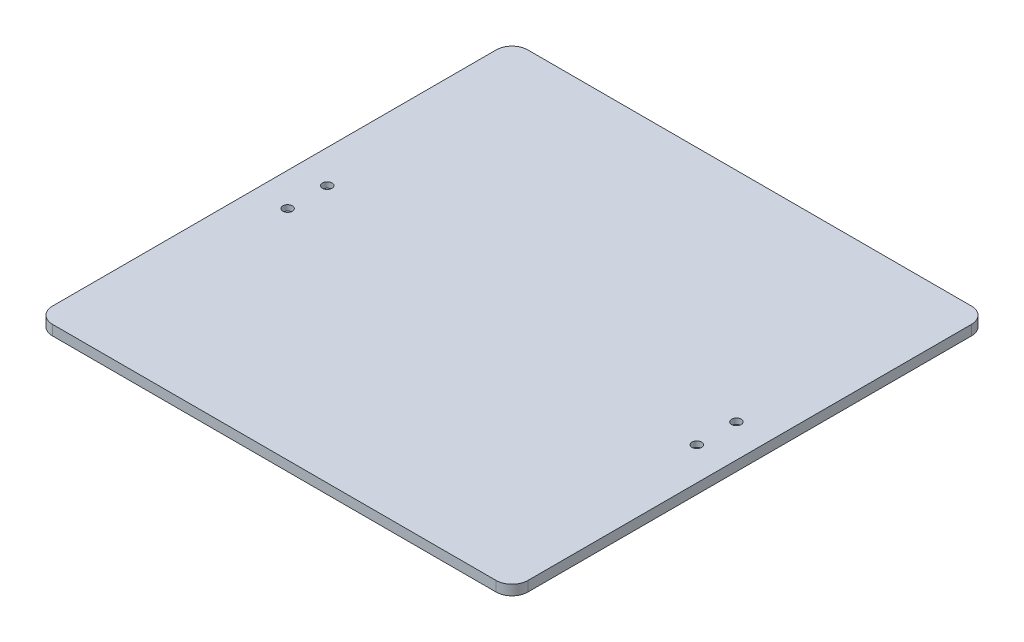
ISO-10303-21;
HEADER;
FILE_DESCRIPTION(('STEP AP214'),'2;1');
FILE_NAME('part.step','',(''),(''),'','','');
FILE_SCHEMA(('AUTOMOTIVE_DESIGN { 1 0 10303 214 1 1 1 1 }'));
ENDSEC;
DATA;
#1=APPLICATION_CONTEXT('core data for automotive mechanical design processes');
#2=APPLICATION_PROTOCOL_DEFINITION('international standard','automotive_design',2000,#1);
#3=PRODUCT_CONTEXT('',#1,'mechanical');
#4=PRODUCT('Part','Part','',(#3));
#5=PRODUCT_RELATED_PRODUCT_CATEGORY('part','',(#4));
#6=PRODUCT_DEFINITION_FORMATION('','',#4);
#7=PRODUCT_DEFINITION_CONTEXT('part definition',#1,'design');
#8=PRODUCT_DEFINITION('design','',#6,#7);
#9=PRODUCT_DEFINITION_SHAPE('','',#8);
#10=(LENGTH_UNIT() NAMED_UNIT(*) SI_UNIT(.MILLI.,.METRE.));
#11=(NAMED_UNIT(*) PLANE_ANGLE_UNIT() SI_UNIT($,.RADIAN.));
#12=(NAMED_UNIT(*) SI_UNIT($,.STERADIAN.) SOLID_ANGLE_UNIT());
#13=UNCERTAINTY_MEASURE_WITH_UNIT(LENGTH_MEASURE(1.E-05),#10,'distance_accuracy_value','');
#14=(GEOMETRIC_REPRESENTATION_CONTEXT(3) GLOBAL_UNCERTAINTY_ASSIGNED_CONTEXT((#13)) GLOBAL_UNIT_ASSIGNED_CONTEXT((#10,
#11,#12)) REPRESENTATION_CONTEXT('',''));
#15=CARTESIAN_POINT('',(0.,0.,0.));
#16=DIRECTION('',(0.,0.,1.));
#17=DIRECTION('',(1.,0.,0.));
#18=AXIS2_PLACEMENT_3D('',#15,#16,#17);
#19=CARTESIAN_POINT('',(129.12,0.,12.5));
#20=DIRECTION('',(0.,1.,0.));
#21=DIRECTION('',(0.,0.,1.));
#22=AXIS2_PLACEMENT_3D('',#19,#20,#21);
#23=CYLINDRICAL_SURFACE('',#22,1.75000000000001);
#24=CARTESIAN_POINT('',(129.12,0.,12.5));
#25=DIRECTION('',(0.,1.,0.));
#26=DIRECTION('',(0.,0.,1.));
#27=AXIS2_PLACEMENT_3D('',#24,#25,#26);
#28=CIRCLE('',#27,1.75000000000001);
#29=CARTESIAN_POINT('',(129.12,0.,14.2500000000001));
#30=VERTEX_POINT('',#29);
#31=EDGE_CURVE('E166',#30,#30,#28,.T.);
#32=ORIENTED_EDGE('',*,*,#31,.F.);
#33=EDGE_LOOP('',(#32));
#34=FACE_BOUND('',#33,.T.);
#35=CARTESIAN_POINT('',(129.12,2.85,12.5));
#36=DIRECTION('',(0.,1.,0.));
#37=DIRECTION('',(0.,0.,1.));
#38=AXIS2_PLACEMENT_3D('',#35,#36,#37);
#39=CIRCLE('',#38,1.75000000000001);
#40=CARTESIAN_POINT('',(129.12,2.85,14.2500000000001));
#41=VERTEX_POINT('',#40);
#42=EDGE_CURVE('E39',#41,#41,#39,.F.);
#43=ORIENTED_EDGE('',*,*,#42,.F.);
#44=EDGE_LOOP('',(#43));
#45=FACE_BOUND('',#44,.T.);
#46=ADVANCED_FACE('F35',(#34,#45),#23,.F.);
#47=CARTESIAN_POINT('',(-129.12,0.,12.5));
#48=DIRECTION('',(0.,1.,0.));
#49=DIRECTION('',(0.,0.,1.));
#50=AXIS2_PLACEMENT_3D('',#47,#48,#49);
#51=CYLINDRICAL_SURFACE('',#50,1.75000000000001);
#52=CARTESIAN_POINT('',(-129.12,0.,12.5));
#53=DIRECTION('',(0.,1.,0.));
#54=DIRECTION('',(0.,0.,1.));
#55=AXIS2_PLACEMENT_3D('',#52,#53,#54);
#56=CIRCLE('',#55,1.75000000000001);
#57=CARTESIAN_POINT('',(-129.12,0.,14.2500000000001));
#58=VERTEX_POINT('',#57);
#59=EDGE_CURVE('E202',#58,#58,#56,.T.);
#60=ORIENTED_EDGE('',*,*,#59,.F.);
#61=EDGE_LOOP('',(#60));
#62=FACE_BOUND('',#61,.T.);
#63=CARTESIAN_POINT('',(-129.12,2.85,12.5));
#64=DIRECTION('',(0.,1.,0.));
#65=DIRECTION('',(0.,0.,1.));
#66=AXIS2_PLACEMENT_3D('',#63,#64,#65);
#67=CIRCLE('',#66,1.75000000000001);
#68=CARTESIAN_POINT('',(-129.12,2.85,14.2500000000001));
#69=VERTEX_POINT('',#68);
#70=EDGE_CURVE('E172',#69,#69,#67,.F.);
#71=ORIENTED_EDGE('',*,*,#70,.F.);
#72=EDGE_LOOP('',(#71));
#73=FACE_BOUND('',#72,.T.);
#74=ADVANCED_FACE('F242',(#62,#73),#51,.F.);
#75=CARTESIAN_POINT('',(129.12,0.,-12.5));
#76=DIRECTION('',(0.,1.,0.));
#77=DIRECTION('',(0.,0.,1.));
#78=AXIS2_PLACEMENT_3D('',#75,#76,#77);
#79=CYLINDRICAL_SURFACE('',#78,1.75000000000001);
#80=CARTESIAN_POINT('',(129.12,0.,-12.5));
#81=DIRECTION('',(0.,1.,0.));
#82=DIRECTION('',(0.,0.,1.));
#83=AXIS2_PLACEMENT_3D('',#80,#81,#82);
#84=CIRCLE('',#83,1.75000000000001);
#85=CARTESIAN_POINT('',(129.12,0.,-10.7499999999999));
#86=VERTEX_POINT('',#85);
#87=EDGE_CURVE('E199',#86,#86,#84,.T.);
#88=ORIENTED_EDGE('',*,*,#87,.F.);
#89=EDGE_LOOP('',(#88));
#90=FACE_BOUND('',#89,.T.);
#91=CARTESIAN_POINT('',(129.12,2.85,-12.5));
#92=DIRECTION('',(0.,1.,0.));
#93=DIRECTION('',(0.,0.,1.));
#94=AXIS2_PLACEMENT_3D('',#91,#92,#93);
#95=CIRCLE('',#94,1.75000000000001);
#96=CARTESIAN_POINT('',(129.12,2.85,-10.7499999999999));
#97=VERTEX_POINT('',#96);
#98=EDGE_CURVE('E168',#97,#97,#95,.F.);
#99=ORIENTED_EDGE('',*,*,#98,.F.);
#100=EDGE_LOOP('',(#99));
#101=FACE_BOUND('',#100,.T.);
#102=ADVANCED_FACE('F249',(#90,#101),#79,.F.);
#103=CARTESIAN_POINT('',(-129.12,0.,-12.5));
#104=DIRECTION('',(0.,1.,0.));
#105=DIRECTION('',(0.,0.,1.));
#106=AXIS2_PLACEMENT_3D('',#103,#104,#105);
#107=CYLINDRICAL_SURFACE('',#106,1.75000000000001);
#108=CARTESIAN_POINT('',(-129.12,0.,-12.5));
#109=DIRECTION('',(0.,1.,0.));
#110=DIRECTION('',(0.,0.,1.));
#111=AXIS2_PLACEMENT_3D('',#108,#109,#110);
#112=CIRCLE('',#111,1.75000000000001);
#113=CARTESIAN_POINT('',(-129.12,0.,-10.7499999999999));
#114=VERTEX_POINT('',#113);
#115=EDGE_CURVE('E135',#114,#114,#112,.T.);
#116=ORIENTED_EDGE('',*,*,#115,.F.);
#117=EDGE_LOOP('',(#116));
#118=FACE_BOUND('',#117,.T.);
#119=CARTESIAN_POINT('',(-129.12,2.85,-12.5));
#120=DIRECTION('',(0.,1.,0.));
#121=DIRECTION('',(0.,0.,1.));
#122=AXIS2_PLACEMENT_3D('',#119,#120,#121);
#123=CIRCLE('',#122,1.75000000000001);
#124=CARTESIAN_POINT('',(-129.12,2.85,-10.7499999999999));
#125=VERTEX_POINT('',#124);
#126=EDGE_CURVE('E163',#125,#125,#123,.F.);
#127=ORIENTED_EDGE('',*,*,#126,.F.);
#128=EDGE_LOOP('',(#127));
#129=FACE_BOUND('',#128,.T.);
#130=ADVANCED_FACE('F257',(#118,#129),#107,.F.);
#131=CARTESIAN_POINT('',(150.,6.35,-150.));
#132=DIRECTION('',(-1.,0.,0.));
#133=DIRECTION('',(0.,0.,1.));
#134=AXIS2_PLACEMENT_3D('',#131,#132,#133);
#135=PLANE('',#134);
#136=DIRECTION('',(0.,0.,-1.));
#137=VECTOR('',#136,1.);
#138=CARTESIAN_POINT('',(150.,0.,-150.));
#139=LINE('',#138,#137);
#140=CARTESIAN_POINT('',(150.,0.,140.));
#141=VERTEX_POINT('',#140);
#142=CARTESIAN_POINT('',(150.,0.,-140.));
#143=VERTEX_POINT('',#142);
#144=EDGE_CURVE('E130',#141,#143,#139,.T.);
#145=ORIENTED_EDGE('',*,*,#144,.T.);
#146=DIRECTION('',(0.,-1.,0.));
#147=VECTOR('',#146,1.);
#148=CARTESIAN_POINT('',(150.,6.35,-140.));
#149=LINE('',#148,#147);
#150=CARTESIAN_POINT('',(150.,6.35,-140.));
#151=VERTEX_POINT('',#150);
#152=EDGE_CURVE('E108',#143,#151,#149,.F.);
#153=ORIENTED_EDGE('',*,*,#152,.T.);
#154=DIRECTION('',(0.,0.,-1.));
#155=VECTOR('',#154,1.);
#156=CARTESIAN_POINT('',(150.,6.35,-150.));
#157=LINE('',#156,#155);
#158=CARTESIAN_POINT('',(150.,6.35,140.));
#159=VERTEX_POINT('',#158);
#160=EDGE_CURVE('E140',#159,#151,#157,.T.);
#161=ORIENTED_EDGE('',*,*,#160,.F.);
#162=DIRECTION('',(0.,-1.,0.));
#163=VECTOR('',#162,1.);
#164=CARTESIAN_POINT('',(150.,6.35,140.));
#165=LINE('',#164,#163);
#166=EDGE_CURVE('E113',#159,#141,#165,.T.);
#167=ORIENTED_EDGE('',*,*,#166,.T.);
#168=EDGE_LOOP('',(#145,#153,#161,#167));
#169=FACE_BOUND('',#168,.T.);
#170=ADVANCED_FACE('F219',(#169),#135,.F.);
#171=CARTESIAN_POINT('',(-150.,6.35,-150.));
#172=DIRECTION('',(0.,0.,1.));
#173=DIRECTION('',(1.,0.,0.));
#174=AXIS2_PLACEMENT_3D('',#171,#172,#173);
#175=PLANE('',#174);
#176=DIRECTION('',(-1.,0.,0.));
#177=VECTOR('',#176,1.);
#178=CARTESIAN_POINT('',(-150.,6.35,-150.));
#179=LINE('',#178,#177);
#180=CARTESIAN_POINT('',(140.,6.35,-150.));
#181=VERTEX_POINT('',#180);
#182=CARTESIAN_POINT('',(-140.,6.35,-150.));
#183=VERTEX_POINT('',#182);
#184=EDGE_CURVE('E123',#181,#183,#179,.T.);
#185=ORIENTED_EDGE('',*,*,#184,.F.);
#186=DIRECTION('',(0.,-1.,0.));
#187=VECTOR('',#186,1.);
#188=CARTESIAN_POINT('',(140.,6.35,-150.));
#189=LINE('',#188,#187);
#190=CARTESIAN_POINT('',(140.,0.,-150.));
#191=VERTEX_POINT('',#190);
#192=EDGE_CURVE('E107',#181,#191,#189,.T.);
#193=ORIENTED_EDGE('',*,*,#192,.T.);
#194=DIRECTION('',(-1.,0.,0.));
#195=VECTOR('',#194,1.);
#196=CARTESIAN_POINT('',(-150.,0.,-150.));
#197=LINE('',#196,#195);
#198=CARTESIAN_POINT('',(-140.,0.,-150.));
#199=VERTEX_POINT('',#198);
#200=EDGE_CURVE('E120',#191,#199,#197,.T.);
#201=ORIENTED_EDGE('',*,*,#200,.T.);
#202=DIRECTION('',(0.,-1.,0.));
#203=VECTOR('',#202,1.);
#204=CARTESIAN_POINT('',(-140.,6.35,-150.));
#205=LINE('',#204,#203);
#206=EDGE_CURVE('E125',#199,#183,#205,.F.);
#207=ORIENTED_EDGE('',*,*,#206,.T.);
#208=EDGE_LOOP('',(#185,#193,#201,#207));
#209=FACE_BOUND('',#208,.T.);
#210=ADVANCED_FACE('F119',(#209),#175,.F.);
#211=CARTESIAN_POINT('',(-150.,6.35,-150.));
#212=DIRECTION('',(1.,0.,0.));
#213=DIRECTION('',(0.,0.,-1.));
#214=AXIS2_PLACEMENT_3D('',#211,#212,#213);
#215=PLANE('',#214);
#216=DIRECTION('',(0.,0.,1.));
#217=VECTOR('',#216,1.);
#218=CARTESIAN_POINT('',(-150.,0.,-150.));
#219=LINE('',#218,#217);
#220=CARTESIAN_POINT('',(-150.,0.,-140.));
#221=VERTEX_POINT('',#220);
#222=CARTESIAN_POINT('',(-150.,0.,140.));
#223=VERTEX_POINT('',#222);
#224=EDGE_CURVE('E129',#221,#223,#219,.T.);
#225=ORIENTED_EDGE('',*,*,#224,.T.);
#226=DIRECTION('',(0.,-1.,0.));
#227=VECTOR('',#226,1.);
#228=CARTESIAN_POINT('',(-150.,6.35,140.));
#229=LINE('',#228,#227);
#230=CARTESIAN_POINT('',(-150.,6.35,140.));
#231=VERTEX_POINT('',#230);
#232=EDGE_CURVE('E11',#223,#231,#229,.F.);
#233=ORIENTED_EDGE('',*,*,#232,.T.);
#234=DIRECTION('',(0.,0.,1.));
#235=VECTOR('',#234,1.);
#236=CARTESIAN_POINT('',(-150.,6.35,-150.));
#237=LINE('',#236,#235);
#238=CARTESIAN_POINT('',(-150.,6.35,-140.));
#239=VERTEX_POINT('',#238);
#240=EDGE_CURVE('E210',#239,#231,#237,.T.);
#241=ORIENTED_EDGE('',*,*,#240,.F.);
#242=DIRECTION('',(0.,-1.,0.));
#243=VECTOR('',#242,1.);
#244=CARTESIAN_POINT('',(-150.,6.35,-140.));
#245=LINE('',#244,#243);
#246=EDGE_CURVE('E44',#239,#221,#245,.T.);
#247=ORIENTED_EDGE('',*,*,#246,.T.);
#248=EDGE_LOOP('',(#225,#233,#241,#247));
#249=FACE_BOUND('',#248,.T.);
#250=ADVANCED_FACE('F226',(#249),#215,.F.);
#251=CARTESIAN_POINT('',(-150.,6.35,150.));
#252=DIRECTION('',(0.,0.,-1.));
#253=DIRECTION('',(-1.,0.,0.));
#254=AXIS2_PLACEMENT_3D('',#251,#252,#253);
#255=PLANE('',#254);
#256=DIRECTION('',(1.,0.,0.));
#257=VECTOR('',#256,1.);
#258=CARTESIAN_POINT('',(-150.,0.,150.));
#259=LINE('',#258,#257);
#260=CARTESIAN_POINT('',(-140.,0.,150.));
#261=VERTEX_POINT('',#260);
#262=CARTESIAN_POINT('',(140.,0.,150.));
#263=VERTEX_POINT('',#262);
#264=EDGE_CURVE('E133',#261,#263,#259,.T.);
#265=ORIENTED_EDGE('',*,*,#264,.T.);
#266=DIRECTION('',(0.,-1.,0.));
#267=VECTOR('',#266,1.);
#268=CARTESIAN_POINT('',(140.,6.35,150.));
#269=LINE('',#268,#267);
#270=CARTESIAN_POINT('',(140.,6.35,150.));
#271=VERTEX_POINT('',#270);
#272=EDGE_CURVE('E52',#263,#271,#269,.F.);
#273=ORIENTED_EDGE('',*,*,#272,.T.);
#274=DIRECTION('',(1.,0.,0.));
#275=VECTOR('',#274,1.);
#276=CARTESIAN_POINT('',(-150.,6.35,150.));
#277=LINE('',#276,#275);
#278=CARTESIAN_POINT('',(-140.,6.35,150.));
#279=VERTEX_POINT('',#278);
#280=EDGE_CURVE('E141',#279,#271,#277,.T.);
#281=ORIENTED_EDGE('',*,*,#280,.F.);
#282=DIRECTION('',(0.,-1.,0.));
#283=VECTOR('',#282,1.);
#284=CARTESIAN_POINT('',(-140.,6.35,150.));
#285=LINE('',#284,#283);
#286=EDGE_CURVE('E157',#279,#261,#285,.T.);
#287=ORIENTED_EDGE('',*,*,#286,.T.);
#288=EDGE_LOOP('',(#265,#273,#281,#287));
#289=FACE_BOUND('',#288,.T.);
#290=ADVANCED_FACE('F221',(#289),#255,.F.);
#291=CARTESIAN_POINT('',(0.,6.35,0.));
#292=DIRECTION('',(0.,1.,0.));
#293=DIRECTION('',(0.,0.,1.));
#294=AXIS2_PLACEMENT_3D('',#291,#292,#293);
#295=PLANE('',#294);
#296=CARTESIAN_POINT('',(129.12,6.35,12.5));
#297=DIRECTION('',(0.,1.,0.));
#298=DIRECTION('',(0.,0.,1.));
#299=AXIS2_PLACEMENT_3D('',#296,#297,#298);
#300=CIRCLE('',#299,2.99999999999999);
#301=CARTESIAN_POINT('',(129.12,6.35,15.5));
#302=VERTEX_POINT('',#301);
#303=EDGE_CURVE('E188',#302,#302,#300,.T.);
#304=ORIENTED_EDGE('',*,*,#303,.F.);
#305=EDGE_LOOP('',(#304));
#306=FACE_BOUND('',#305,.T.);
#307=CARTESIAN_POINT('',(-129.12,6.35,12.5));
#308=DIRECTION('',(0.,1.,0.));
#309=DIRECTION('',(0.,0.,1.));
#310=AXIS2_PLACEMENT_3D('',#307,#308,#309);
#311=CIRCLE('',#310,2.99999999999999);
#312=CARTESIAN_POINT('',(-129.12,6.35,15.5));
#313=VERTEX_POINT('',#312);
#314=EDGE_CURVE('E181',#313,#313,#311,.T.);
#315=ORIENTED_EDGE('',*,*,#314,.F.);
#316=EDGE_LOOP('',(#315));
#317=FACE_BOUND('',#316,.T.);
#318=CARTESIAN_POINT('',(129.12,6.35,-12.5));
#319=DIRECTION('',(0.,1.,0.));
#320=DIRECTION('',(0.,0.,1.));
#321=AXIS2_PLACEMENT_3D('',#318,#319,#320);
#322=CIRCLE('',#321,2.99999999999999);
#323=CARTESIAN_POINT('',(129.12,6.35,-9.49999999999996));
#324=VERTEX_POINT('',#323);
#325=EDGE_CURVE('E174',#324,#324,#322,.T.);
#326=ORIENTED_EDGE('',*,*,#325,.F.);
#327=EDGE_LOOP('',(#326));
#328=FACE_BOUND('',#327,.T.);
#329=CARTESIAN_POINT('',(-129.12,6.35,-12.5));
#330=DIRECTION('',(0.,1.,0.));
#331=DIRECTION('',(0.,0.,1.));
#332=AXIS2_PLACEMENT_3D('',#329,#330,#331);
#333=CIRCLE('',#332,2.99999999999999);
#334=CARTESIAN_POINT('',(-129.12,6.35,-9.49999999999996));
#335=VERTEX_POINT('',#334);
#336=EDGE_CURVE('E170',#335,#335,#333,.T.);
#337=ORIENTED_EDGE('',*,*,#336,.F.);
#338=EDGE_LOOP('',(#337));
#339=FACE_BOUND('',#338,.T.);
#340=ORIENTED_EDGE('',*,*,#160,.T.);
#341=CARTESIAN_POINT('',(140.,6.35,-140.));
#342=DIRECTION('',(0.,1.,0.));
#343=DIRECTION('',(0.,0.,1.));
#344=AXIS2_PLACEMENT_3D('',#341,#342,#343);
#345=CIRCLE('',#344,10.);
#346=EDGE_CURVE('E155',#151,#181,#345,.T.);
#347=ORIENTED_EDGE('',*,*,#346,.T.);
#348=ORIENTED_EDGE('',*,*,#184,.T.);
#349=CARTESIAN_POINT('',(-140.,6.35,-140.));
#350=DIRECTION('',(0.,1.,0.));
#351=DIRECTION('',(0.,0.,1.));
#352=AXIS2_PLACEMENT_3D('',#349,#350,#351);
#353=CIRCLE('',#352,10.);
#354=EDGE_CURVE('E150',#183,#239,#353,.T.);
#355=ORIENTED_EDGE('',*,*,#354,.T.);
#356=ORIENTED_EDGE('',*,*,#240,.T.);
#357=CARTESIAN_POINT('',(-140.,6.35,140.));
#358=DIRECTION('',(0.,1.,0.));
#359=DIRECTION('',(0.,0.,1.));
#360=AXIS2_PLACEMENT_3D('',#357,#358,#359);
#361=CIRCLE('',#360,10.);
#362=EDGE_CURVE('E59',#231,#279,#361,.T.);
#363=ORIENTED_EDGE('',*,*,#362,.T.);
#364=ORIENTED_EDGE('',*,*,#280,.T.);
#365=CARTESIAN_POINT('',(140.,6.35,140.));
#366=DIRECTION('',(0.,1.,0.));
#367=DIRECTION('',(0.,0.,1.));
#368=AXIS2_PLACEMENT_3D('',#365,#366,#367);
#369=CIRCLE('',#368,10.);
#370=EDGE_CURVE('E153',#271,#159,#369,.T.);
#371=ORIENTED_EDGE('',*,*,#370,.T.);
#372=EDGE_LOOP('',(#340,#347,#348,#355,#356,#363,#364,#371));
#373=FACE_BOUND('',#372,.T.);
#374=ADVANCED_FACE('F212',(#306,#317,#328,#339,#373),#295,.T.);
#375=CARTESIAN_POINT('',(0.,0.,0.));
#376=DIRECTION('',(0.,1.,0.));
#377=DIRECTION('',(0.,0.,1.));
#378=AXIS2_PLACEMENT_3D('',#375,#376,#377);
#379=PLANE('',#378);
#380=ORIENTED_EDGE('',*,*,#31,.T.);
#381=EDGE_LOOP('',(#380));
#382=FACE_BOUND('',#381,.T.);
#383=ORIENTED_EDGE('',*,*,#87,.T.);
#384=EDGE_LOOP('',(#383));
#385=FACE_BOUND('',#384,.T.);
#386=ORIENTED_EDGE('',*,*,#59,.T.);
#387=EDGE_LOOP('',(#386));
#388=FACE_BOUND('',#387,.T.);
#389=ORIENTED_EDGE('',*,*,#115,.T.);
#390=EDGE_LOOP('',(#389));
#391=FACE_BOUND('',#390,.T.);
#392=ORIENTED_EDGE('',*,*,#200,.F.);
#393=CARTESIAN_POINT('',(140.,0.,-140.));
#394=DIRECTION('',(0.,1.,0.));
#395=DIRECTION('',(0.,0.,1.));
#396=AXIS2_PLACEMENT_3D('',#393,#394,#395);
#397=CIRCLE('',#396,10.);
#398=EDGE_CURVE('E103',#191,#143,#397,.F.);
#399=ORIENTED_EDGE('',*,*,#398,.T.);
#400=ORIENTED_EDGE('',*,*,#144,.F.);
#401=CARTESIAN_POINT('',(140.,0.,140.));
#402=DIRECTION('',(0.,1.,0.));
#403=DIRECTION('',(0.,0.,1.));
#404=AXIS2_PLACEMENT_3D('',#401,#402,#403);
#405=CIRCLE('',#404,10.);
#406=EDGE_CURVE('E114',#141,#263,#405,.F.);
#407=ORIENTED_EDGE('',*,*,#406,.T.);
#408=ORIENTED_EDGE('',*,*,#264,.F.);
#409=CARTESIAN_POINT('',(-140.,0.,140.));
#410=DIRECTION('',(0.,1.,0.));
#411=DIRECTION('',(0.,0.,1.));
#412=AXIS2_PLACEMENT_3D('',#409,#410,#411);
#413=CIRCLE('',#412,10.);
#414=EDGE_CURVE('E144',#261,#223,#413,.F.);
#415=ORIENTED_EDGE('',*,*,#414,.T.);
#416=ORIENTED_EDGE('',*,*,#224,.F.);
#417=CARTESIAN_POINT('',(-140.,0.,-140.));
#418=DIRECTION('',(0.,1.,0.));
#419=DIRECTION('',(0.,0.,1.));
#420=AXIS2_PLACEMENT_3D('',#417,#418,#419);
#421=CIRCLE('',#420,10.);
#422=EDGE_CURVE('E124',#221,#199,#421,.F.);
#423=ORIENTED_EDGE('',*,*,#422,.T.);
#424=EDGE_LOOP('',(#392,#399,#400,#407,#408,#415,#416,#423));
#425=FACE_BOUND('',#424,.T.);
#426=ADVANCED_FACE('F127',(#382,#385,#388,#391,#425),#379,.F.);
#427=CARTESIAN_POINT('',(140.,6.35,-140.));
#428=DIRECTION('',(0.,-1.,0.));
#429=DIRECTION('',(0.,0.,-1.));
#430=AXIS2_PLACEMENT_3D('',#427,#428,#429);
#431=CYLINDRICAL_SURFACE('',#430,10.);
#432=ORIENTED_EDGE('',*,*,#346,.F.);
#433=ORIENTED_EDGE('',*,*,#152,.F.);
#434=ORIENTED_EDGE('',*,*,#398,.F.);
#435=ORIENTED_EDGE('',*,*,#192,.F.);
#436=EDGE_LOOP('',(#432,#433,#434,#435));
#437=FACE_BOUND('',#436,.T.);
#438=ADVANCED_FACE('F106',(#437),#431,.T.);
#439=CARTESIAN_POINT('',(140.,6.35,140.));
#440=DIRECTION('',(0.,-1.,0.));
#441=DIRECTION('',(0.,0.,-1.));
#442=AXIS2_PLACEMENT_3D('',#439,#440,#441);
#443=CYLINDRICAL_SURFACE('',#442,10.);
#444=ORIENTED_EDGE('',*,*,#370,.F.);
#445=ORIENTED_EDGE('',*,*,#272,.F.);
#446=ORIENTED_EDGE('',*,*,#406,.F.);
#447=ORIENTED_EDGE('',*,*,#166,.F.);
#448=EDGE_LOOP('',(#444,#445,#446,#447));
#449=FACE_BOUND('',#448,.T.);
#450=ADVANCED_FACE('F217',(#449),#443,.T.);
#451=CARTESIAN_POINT('',(-140.,6.35,140.));
#452=DIRECTION('',(0.,-1.,0.));
#453=DIRECTION('',(0.,0.,-1.));
#454=AXIS2_PLACEMENT_3D('',#451,#452,#453);
#455=CYLINDRICAL_SURFACE('',#454,10.);
#456=ORIENTED_EDGE('',*,*,#362,.F.);
#457=ORIENTED_EDGE('',*,*,#232,.F.);
#458=ORIENTED_EDGE('',*,*,#414,.F.);
#459=ORIENTED_EDGE('',*,*,#286,.F.);
#460=EDGE_LOOP('',(#456,#457,#458,#459));
#461=FACE_BOUND('',#460,.T.);
#462=ADVANCED_FACE('F223',(#461),#455,.T.);
#463=CARTESIAN_POINT('',(-140.,6.35,-140.));
#464=DIRECTION('',(0.,-1.,0.));
#465=DIRECTION('',(0.,0.,-1.));
#466=AXIS2_PLACEMENT_3D('',#463,#464,#465);
#467=CYLINDRICAL_SURFACE('',#466,10.);
#468=ORIENTED_EDGE('',*,*,#354,.F.);
#469=ORIENTED_EDGE('',*,*,#206,.F.);
#470=ORIENTED_EDGE('',*,*,#422,.F.);
#471=ORIENTED_EDGE('',*,*,#246,.F.);
#472=EDGE_LOOP('',(#468,#469,#470,#471));
#473=FACE_BOUND('',#472,.T.);
#474=ADVANCED_FACE('F37',(#473),#467,.T.);
#475=CARTESIAN_POINT('',(-129.12,2.85,-12.5));
#476=DIRECTION('',(0.,1.,0.));
#477=DIRECTION('',(0.,0.,1.));
#478=AXIS2_PLACEMENT_3D('',#475,#476,#477);
#479=PLANE('',#478);
#480=CARTESIAN_POINT('',(-129.12,2.85,-12.5));
#481=DIRECTION('',(0.,1.,0.));
#482=DIRECTION('',(0.,0.,1.));
#483=AXIS2_PLACEMENT_3D('',#480,#481,#482);
#484=CIRCLE('',#483,2.99999999999999);
#485=CARTESIAN_POINT('',(-129.12,2.85,-9.49999999999996));
#486=VERTEX_POINT('',#485);
#487=EDGE_CURVE('E167',#486,#486,#484,.T.);
#488=ORIENTED_EDGE('',*,*,#487,.T.);
#489=EDGE_LOOP('',(#488));
#490=FACE_BOUND('',#489,.T.);
#491=ORIENTED_EDGE('',*,*,#126,.T.);
#492=EDGE_LOOP('',(#491));
#493=FACE_BOUND('',#492,.T.);
#494=ADVANCED_FACE('F232',(#490,#493),#479,.T.);
#495=CARTESIAN_POINT('',(-129.12,2.85,-12.5));
#496=DIRECTION('',(0.,1.,0.));
#497=DIRECTION('',(0.,0.,1.));
#498=AXIS2_PLACEMENT_3D('',#495,#496,#497);
#499=CYLINDRICAL_SURFACE('',#498,2.99999999999999);
#500=ORIENTED_EDGE('',*,*,#487,.F.);
#501=EDGE_LOOP('',(#500));
#502=FACE_BOUND('',#501,.T.);
#503=ORIENTED_EDGE('',*,*,#336,.T.);
#504=EDGE_LOOP('',(#503));
#505=FACE_BOUND('',#504,.T.);
#506=ADVANCED_FACE('F238',(#502,#505),#499,.F.);
#507=CARTESIAN_POINT('',(129.12,2.85,-12.5));
#508=DIRECTION('',(0.,1.,0.));
#509=DIRECTION('',(0.,0.,1.));
#510=AXIS2_PLACEMENT_3D('',#507,#508,#509);
#511=PLANE('',#510);
#512=CARTESIAN_POINT('',(129.12,2.85,-12.5));
#513=DIRECTION('',(0.,1.,0.));
#514=DIRECTION('',(0.,0.,1.));
#515=AXIS2_PLACEMENT_3D('',#512,#513,#514);
#516=CIRCLE('',#515,2.99999999999999);
#517=CARTESIAN_POINT('',(129.12,2.85,-9.49999999999996));
#518=VERTEX_POINT('',#517);
#519=EDGE_CURVE('E171',#518,#518,#516,.T.);
#520=ORIENTED_EDGE('',*,*,#519,.T.);
#521=EDGE_LOOP('',(#520));
#522=FACE_BOUND('',#521,.T.);
#523=ORIENTED_EDGE('',*,*,#98,.T.);
#524=EDGE_LOOP('',(#523));
#525=FACE_BOUND('',#524,.T.);
#526=ADVANCED_FACE('F319',(#522,#525),#511,.T.);
#527=CARTESIAN_POINT('',(129.12,2.85,-12.5));
#528=DIRECTION('',(0.,1.,0.));
#529=DIRECTION('',(0.,0.,1.));
#530=AXIS2_PLACEMENT_3D('',#527,#528,#529);
#531=CYLINDRICAL_SURFACE('',#530,2.99999999999999);
#532=ORIENTED_EDGE('',*,*,#519,.F.);
#533=EDGE_LOOP('',(#532));
#534=FACE_BOUND('',#533,.T.);
#535=ORIENTED_EDGE('',*,*,#325,.T.);
#536=EDGE_LOOP('',(#535));
#537=FACE_BOUND('',#536,.T.);
#538=ADVANCED_FACE('F329',(#534,#537),#531,.F.);
#539=CARTESIAN_POINT('',(-129.12,2.85,12.5));
#540=DIRECTION('',(0.,1.,0.));
#541=DIRECTION('',(0.,0.,1.));
#542=AXIS2_PLACEMENT_3D('',#539,#540,#541);
#543=PLANE('',#542);
#544=CARTESIAN_POINT('',(-129.12,2.85,12.5));
#545=DIRECTION('',(0.,1.,0.));
#546=DIRECTION('',(0.,0.,1.));
#547=AXIS2_PLACEMENT_3D('',#544,#545,#546);
#548=CIRCLE('',#547,2.99999999999999);
#549=CARTESIAN_POINT('',(-129.12,2.85,15.5));
#550=VERTEX_POINT('',#549);
#551=EDGE_CURVE('E175',#550,#550,#548,.T.);
#552=ORIENTED_EDGE('',*,*,#551,.T.);
#553=EDGE_LOOP('',(#552));
#554=FACE_BOUND('',#553,.T.);
#555=ORIENTED_EDGE('',*,*,#70,.T.);
#556=EDGE_LOOP('',(#555));
#557=FACE_BOUND('',#556,.T.);
#558=ADVANCED_FACE('F337',(#554,#557),#543,.T.);
#559=CARTESIAN_POINT('',(-129.12,2.85,12.5));
#560=DIRECTION('',(0.,1.,0.));
#561=DIRECTION('',(0.,0.,1.));
#562=AXIS2_PLACEMENT_3D('',#559,#560,#561);
#563=CYLINDRICAL_SURFACE('',#562,2.99999999999999);
#564=ORIENTED_EDGE('',*,*,#551,.F.);
#565=EDGE_LOOP('',(#564));
#566=FACE_BOUND('',#565,.T.);
#567=ORIENTED_EDGE('',*,*,#314,.T.);
#568=EDGE_LOOP('',(#567));
#569=FACE_BOUND('',#568,.T.);
#570=ADVANCED_FACE('F345',(#566,#569),#563,.F.);
#571=CARTESIAN_POINT('',(129.12,2.85,12.5));
#572=DIRECTION('',(0.,1.,0.));
#573=DIRECTION('',(0.,0.,1.));
#574=AXIS2_PLACEMENT_3D('',#571,#572,#573);
#575=PLANE('',#574);
#576=CARTESIAN_POINT('',(129.12,2.85,12.5));
#577=DIRECTION('',(0.,1.,0.));
#578=DIRECTION('',(0.,0.,1.));
#579=AXIS2_PLACEMENT_3D('',#576,#577,#578);
#580=CIRCLE('',#579,2.99999999999999);
#581=CARTESIAN_POINT('',(129.12,2.85,15.5));
#582=VERTEX_POINT('',#581);
#583=EDGE_CURVE('E434',#582,#582,#580,.T.);
#584=ORIENTED_EDGE('',*,*,#583,.T.);
#585=EDGE_LOOP('',(#584));
#586=FACE_BOUND('',#585,.T.);
#587=ORIENTED_EDGE('',*,*,#42,.T.);
#588=EDGE_LOOP('',(#587));
#589=FACE_BOUND('',#588,.T.);
#590=ADVANCED_FACE('F352',(#586,#589),#575,.T.);
#591=CARTESIAN_POINT('',(129.12,2.85,12.5));
#592=DIRECTION('',(0.,1.,0.));
#593=DIRECTION('',(0.,0.,1.));
#594=AXIS2_PLACEMENT_3D('',#591,#592,#593);
#595=CYLINDRICAL_SURFACE('',#594,2.99999999999999);
#596=ORIENTED_EDGE('',*,*,#583,.F.);
#597=EDGE_LOOP('',(#596));
#598=FACE_BOUND('',#597,.T.);
#599=ORIENTED_EDGE('',*,*,#303,.T.);
#600=EDGE_LOOP('',(#599));
#601=FACE_BOUND('',#600,.T.);
#602=ADVANCED_FACE('F360',(#598,#601),#595,.F.);
#603=CLOSED_SHELL('',(#46,#74,#102,#130,#170,#210,#250,#290,#374,#426,#438,#450,#462,#474,#494,
#506,#526,#538,#558,#570,#590,#602));
#604=MANIFOLD_SOLID_BREP('B2',#603);
#605=ADVANCED_BREP_SHAPE_REPRESENTATION('',(#18,#604),#14);
#606=SHAPE_DEFINITION_REPRESENTATION(#9,#605);
ENDSEC;
END-ISO-10303-21;
